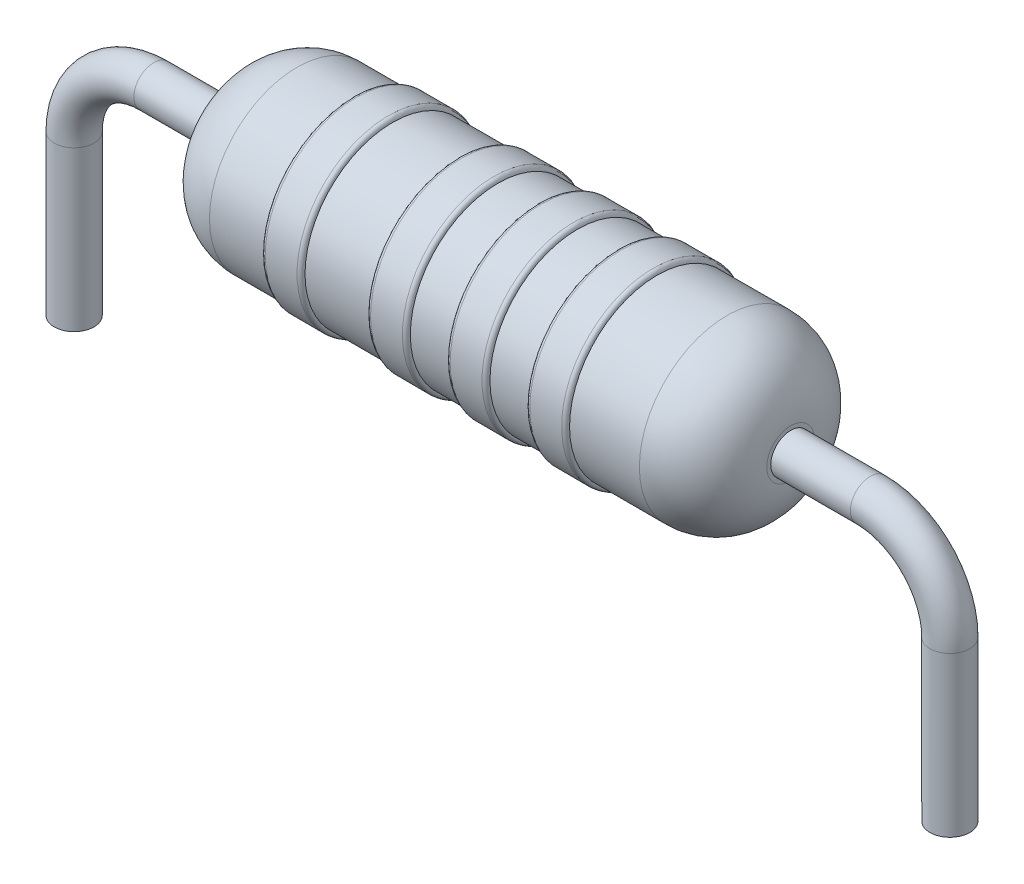
ISO-10303-21;
HEADER;
FILE_DESCRIPTION(('STEP AP214'),'2;1');
FILE_NAME('part.step','',(''),(''),'','','');
FILE_SCHEMA(('AUTOMOTIVE_DESIGN { 1 0 10303 214 1 1 1 1 }'));
ENDSEC;
DATA;
#1=APPLICATION_CONTEXT('core data for automotive mechanical design processes');
#2=APPLICATION_PROTOCOL_DEFINITION('international standard','automotive_design',2000,#1);
#3=PRODUCT_CONTEXT('',#1,'mechanical');
#4=PRODUCT('Part','Part','',(#3));
#5=PRODUCT_RELATED_PRODUCT_CATEGORY('part','',(#4));
#6=PRODUCT_DEFINITION_FORMATION('','',#4);
#7=PRODUCT_DEFINITION_CONTEXT('part definition',#1,'design');
#8=PRODUCT_DEFINITION('design','',#6,#7);
#9=PRODUCT_DEFINITION_SHAPE('','',#8);
#10=(LENGTH_UNIT() NAMED_UNIT(*) SI_UNIT(.MILLI.,.METRE.));
#11=(NAMED_UNIT(*) PLANE_ANGLE_UNIT() SI_UNIT($,.RADIAN.));
#12=(NAMED_UNIT(*) SI_UNIT($,.STERADIAN.) SOLID_ANGLE_UNIT());
#13=UNCERTAINTY_MEASURE_WITH_UNIT(LENGTH_MEASURE(1.E-05),#10,'distance_accuracy_value','');
#14=(GEOMETRIC_REPRESENTATION_CONTEXT(3) GLOBAL_UNCERTAINTY_ASSIGNED_CONTEXT((#13)) GLOBAL_UNIT_ASSIGNED_CONTEXT((#10,
#11,#12)) REPRESENTATION_CONTEXT('',''));
#15=CARTESIAN_POINT('',(0.,0.,0.));
#16=DIRECTION('',(0.,0.,1.));
#17=DIRECTION('',(1.,0.,0.));
#18=AXIS2_PLACEMENT_3D('',#15,#16,#17);
#19=CARTESIAN_POINT('',(-3.5,0.,0.));
#20=DIRECTION('',(1.,0.,0.));
#21=DIRECTION('',(0.,0.,-1.));
#22=AXIS2_PLACEMENT_3D('',#19,#20,#21);
#23=PLANE('',#22);
#24=CARTESIAN_POINT('',(-3.5,0.,0.));
#25=DIRECTION('',(-1.,0.,0.));
#26=DIRECTION('',(0.,0.,1.));
#27=AXIS2_PLACEMENT_3D('',#24,#25,#26);
#28=CIRCLE('',#27,0.299999999999995);
#29=CARTESIAN_POINT('',(-3.5,0.,0.299999999999995));
#30=VERTEX_POINT('',#29);
#31=EDGE_CURVE('E61',#30,#30,#28,.T.);
#32=ORIENTED_EDGE('',*,*,#31,.T.);
#33=EDGE_LOOP('',(#32));
#34=FACE_BOUND('',#33,.T.);
#35=CARTESIAN_POINT('',(-3.5,0.,0.));
#36=DIRECTION('',(-1.,0.,0.));
#37=DIRECTION('',(0.,0.,1.));
#38=AXIS2_PLACEMENT_3D('',#35,#36,#37);
#39=CIRCLE('',#38,0.25);
#40=CARTESIAN_POINT('',(-3.5,0.,0.25));
#41=VERTEX_POINT('',#40);
#42=EDGE_CURVE('E10',#41,#41,#39,.T.);
#43=ORIENTED_EDGE('',*,*,#42,.F.);
#44=EDGE_LOOP('',(#43));
#45=FACE_BOUND('',#44,.T.);
#46=ADVANCED_FACE('F34',(#34,#45),#23,.F.);
#47=CARTESIAN_POINT('',(-54.2686615886834,0.,0.));
#48=DIRECTION('',(-1.,0.,0.));
#49=DIRECTION('',(0.,0.,1.));
#50=AXIS2_PLACEMENT_3D('',#47,#48,#49);
#51=CYLINDRICAL_SURFACE('',#50,1.1);
#52=CARTESIAN_POINT('',(0.322975145638588,0.,0.));
#53=DIRECTION('',(-1.,0.,0.));
#54=DIRECTION('',(0.,0.,1.));
#55=AXIS2_PLACEMENT_3D('',#52,#53,#54);
#56=CIRCLE('',#55,1.1);
#57=CARTESIAN_POINT('',(0.322975145638588,0.,1.1));
#58=VERTEX_POINT('',#57);
#59=EDGE_CURVE('E81',#58,#58,#56,.T.);
#60=ORIENTED_EDGE('',*,*,#59,.T.);
#61=EDGE_LOOP('',(#60));
#62=FACE_BOUND('',#61,.T.);
#63=CARTESIAN_POINT('',(-0.177024854361413,0.,0.));
#64=DIRECTION('',(1.,0.,0.));
#65=DIRECTION('',(0.,0.,-1.));
#66=AXIS2_PLACEMENT_3D('',#63,#64,#65);
#67=CIRCLE('',#66,1.1);
#68=CARTESIAN_POINT('',(-0.177024854361413,0.,-1.1));
#69=VERTEX_POINT('',#68);
#70=EDGE_CURVE('E65',#69,#69,#67,.T.);
#71=ORIENTED_EDGE('',*,*,#70,.T.);
#72=EDGE_LOOP('',(#71));
#73=FACE_BOUND('',#72,.T.);
#74=ADVANCED_FACE('F149',(#62,#73),#51,.T.);
#75=CARTESIAN_POINT('',(4.3261723446646,0.,0.));
#76=DIRECTION('',(1.,0.,0.));
#77=DIRECTION('',(0.,0.,-1.));
#78=AXIS2_PLACEMENT_3D('',#75,#76,#77);
#79=CYLINDRICAL_SURFACE('',#78,1.15);
#80=CARTESIAN_POINT('',(-0.627024854361412,0.,0.));
#81=DIRECTION('',(-1.,0.,0.));
#82=DIRECTION('',(0.,0.,1.));
#83=AXIS2_PLACEMENT_3D('',#80,#81,#82);
#84=CIRCLE('',#83,1.15);
#85=CARTESIAN_POINT('',(-0.627024854361412,0.,1.15));
#86=VERTEX_POINT('',#85);
#87=EDGE_CURVE('E105',#86,#86,#84,.F.);
#88=ORIENTED_EDGE('',*,*,#87,.T.);
#89=EDGE_LOOP('',(#88));
#90=FACE_BOUND('',#89,.T.);
#91=CARTESIAN_POINT('',(-0.227024854361414,0.,0.));
#92=DIRECTION('',(1.,0.,0.));
#93=DIRECTION('',(0.,0.,-1.));
#94=AXIS2_PLACEMENT_3D('',#91,#92,#93);
#95=CIRCLE('',#94,1.15);
#96=CARTESIAN_POINT('',(-0.227024854361414,0.,-1.15));
#97=VERTEX_POINT('',#96);
#98=EDGE_CURVE('E102',#97,#97,#95,.F.);
#99=ORIENTED_EDGE('',*,*,#98,.T.);
#100=EDGE_LOOP('',(#99));
#101=FACE_BOUND('',#100,.T.);
#102=ADVANCED_FACE('F155',(#90,#101),#79,.T.);
#103=CARTESIAN_POINT('',(-1.5,0.,0.));
#104=DIRECTION('',(1.,0.,0.));
#105=DIRECTION('',(0.,0.,-1.));
#106=AXIS2_PLACEMENT_3D('',#103,#104,#105);
#107=CIRCLE('',#106,1.1);
#108=CARTESIAN_POINT('',(-1.5,0.,-1.1));
#109=VERTEX_POINT('',#108);
#110=EDGE_CURVE('E60',#109,#109,#107,.T.);
#111=ORIENTED_EDGE('',*,*,#110,.T.);
#112=EDGE_LOOP('',(#111));
#113=FACE_BOUND('',#112,.T.);
#114=CARTESIAN_POINT('',(-0.677024854361413,0.,0.));
#115=DIRECTION('',(-1.,0.,0.));
#116=DIRECTION('',(0.,0.,1.));
#117=AXIS2_PLACEMENT_3D('',#114,#115,#116);
#118=CIRCLE('',#117,1.1);
#119=CARTESIAN_POINT('',(-0.677024854361413,0.,1.1));
#120=VERTEX_POINT('',#119);
#121=EDGE_CURVE('E75',#120,#120,#118,.T.);
#122=ORIENTED_EDGE('',*,*,#121,.T.);
#123=EDGE_LOOP('',(#122));
#124=FACE_BOUND('',#123,.T.);
#125=ADVANCED_FACE('F157',(#113,#124),#51,.T.);
#126=CARTESIAN_POINT('',(4.3261723446646,0.,0.));
#127=DIRECTION('',(1.,0.,0.));
#128=DIRECTION('',(0.,0.,-1.));
#129=AXIS2_PLACEMENT_3D('',#126,#127,#128);
#130=CYLINDRICAL_SURFACE('',#129,1.15);
#131=CARTESIAN_POINT('',(0.372975145638589,0.,0.));
#132=DIRECTION('',(-1.,0.,0.));
#133=DIRECTION('',(0.,0.,1.));
#134=AXIS2_PLACEMENT_3D('',#131,#132,#133);
#135=CIRCLE('',#134,1.15);
#136=CARTESIAN_POINT('',(0.372975145638589,0.,1.15));
#137=VERTEX_POINT('',#136);
#138=EDGE_CURVE('E111',#137,#137,#135,.F.);
#139=ORIENTED_EDGE('',*,*,#138,.T.);
#140=EDGE_LOOP('',(#139));
#141=FACE_BOUND('',#140,.T.);
#142=CARTESIAN_POINT('',(0.772975145638587,0.,0.));
#143=DIRECTION('',(1.,0.,0.));
#144=DIRECTION('',(0.,0.,-1.));
#145=AXIS2_PLACEMENT_3D('',#142,#143,#144);
#146=CIRCLE('',#145,1.15);
#147=CARTESIAN_POINT('',(0.772975145638587,0.,-1.15));
#148=VERTEX_POINT('',#147);
#149=EDGE_CURVE('E108',#148,#148,#146,.F.);
#150=ORIENTED_EDGE('',*,*,#149,.T.);
#151=EDGE_LOOP('',(#150));
#152=FACE_BOUND('',#151,.T.);
#153=ADVANCED_FACE('F166',(#141,#152),#130,.T.);
#154=CARTESIAN_POINT('',(1.32297514563859,0.,0.));
#155=DIRECTION('',(-1.,0.,0.));
#156=DIRECTION('',(0.,0.,1.));
#157=AXIS2_PLACEMENT_3D('',#154,#155,#156);
#158=CIRCLE('',#157,1.1);
#159=CARTESIAN_POINT('',(1.32297514563859,0.,1.1));
#160=VERTEX_POINT('',#159);
#161=EDGE_CURVE('E87',#160,#160,#158,.T.);
#162=ORIENTED_EDGE('',*,*,#161,.T.);
#163=EDGE_LOOP('',(#162));
#164=FACE_BOUND('',#163,.T.);
#165=CARTESIAN_POINT('',(0.822975145638588,0.,0.));
#166=DIRECTION('',(1.,0.,0.));
#167=DIRECTION('',(0.,0.,-1.));
#168=AXIS2_PLACEMENT_3D('',#165,#166,#167);
#169=CIRCLE('',#168,1.1);
#170=CARTESIAN_POINT('',(0.822975145638588,0.,-1.1));
#171=VERTEX_POINT('',#170);
#172=EDGE_CURVE('E78',#171,#171,#169,.T.);
#173=ORIENTED_EDGE('',*,*,#172,.T.);
#174=EDGE_LOOP('',(#173));
#175=FACE_BOUND('',#174,.T.);
#176=ADVANCED_FACE('F132',(#164,#175),#51,.T.);
#177=CARTESIAN_POINT('',(4.3261723446646,0.,0.));
#178=DIRECTION('',(1.,0.,0.));
#179=DIRECTION('',(0.,0.,-1.));
#180=AXIS2_PLACEMENT_3D('',#177,#178,#179);
#181=CYLINDRICAL_SURFACE('',#180,1.15);
#182=CARTESIAN_POINT('',(1.37297514563859,0.,0.));
#183=DIRECTION('',(-1.,0.,0.));
#184=DIRECTION('',(0.,0.,1.));
#185=AXIS2_PLACEMENT_3D('',#182,#183,#184);
#186=CIRCLE('',#185,1.15);
#187=CARTESIAN_POINT('',(1.37297514563859,0.,1.15));
#188=VERTEX_POINT('',#187);
#189=EDGE_CURVE('E38',#188,#188,#186,.F.);
#190=ORIENTED_EDGE('',*,*,#189,.T.);
#191=EDGE_LOOP('',(#190));
#192=FACE_BOUND('',#191,.T.);
#193=CARTESIAN_POINT('',(1.77297514563859,0.,0.));
#194=DIRECTION('',(1.,0.,0.));
#195=DIRECTION('',(0.,0.,-1.));
#196=AXIS2_PLACEMENT_3D('',#193,#194,#195);
#197=CIRCLE('',#196,1.15);
#198=CARTESIAN_POINT('',(1.77297514563859,0.,-1.15));
#199=VERTEX_POINT('',#198);
#200=EDGE_CURVE('E46',#199,#199,#197,.F.);
#201=ORIENTED_EDGE('',*,*,#200,.T.);
#202=EDGE_LOOP('',(#201));
#203=FACE_BOUND('',#202,.T.);
#204=ADVANCED_FACE('F116',(#192,#203),#181,.T.);
#205=CARTESIAN_POINT('',(3.5,0.299999999999995,0.));
#206=DIRECTION('',(-1.,0.,0.));
#207=DIRECTION('',(0.,0.,1.));
#208=AXIS2_PLACEMENT_3D('',#205,#206,#207);
#209=PLANE('',#208);
#210=CARTESIAN_POINT('',(3.5,0.,0.));
#211=DIRECTION('',(-1.,0.,0.));
#212=DIRECTION('',(0.,0.,1.));
#213=AXIS2_PLACEMENT_3D('',#210,#211,#212);
#214=CIRCLE('',#213,0.25);
#215=CARTESIAN_POINT('',(3.5,0.,0.25));
#216=VERTEX_POINT('',#215);
#217=EDGE_CURVE('E263',#216,#216,#214,.T.);
#218=ORIENTED_EDGE('',*,*,#217,.T.);
#219=EDGE_LOOP('',(#218));
#220=FACE_BOUND('',#219,.T.);
#221=CARTESIAN_POINT('',(3.5,0.,0.));
#222=DIRECTION('',(-1.,0.,0.));
#223=DIRECTION('',(0.,0.,1.));
#224=AXIS2_PLACEMENT_3D('',#221,#222,#223);
#225=CIRCLE('',#224,0.299999999999995);
#226=CARTESIAN_POINT('',(3.5,0.,0.299999999999995));
#227=VERTEX_POINT('',#226);
#228=EDGE_CURVE('E71',#227,#227,#225,.T.);
#229=ORIENTED_EDGE('',*,*,#228,.F.);
#230=EDGE_LOOP('',(#229));
#231=FACE_BOUND('',#230,.T.);
#232=ADVANCED_FACE('F36',(#220,#231),#209,.F.);
#233=CARTESIAN_POINT('',(2.7,0.,0.));
#234=DIRECTION('',(-1.,0.,0.));
#235=DIRECTION('',(0.,0.,1.));
#236=AXIS2_PLACEMENT_3D('',#233,#234,#235);
#237=DEGENERATE_TOROIDAL_SURFACE('',#236,0.3,0.8,.T.);
#238=CARTESIAN_POINT('',(2.69999999999999,0.,0.));
#239=DIRECTION('',(-1.,0.,0.));
#240=DIRECTION('',(0.,0.,1.));
#241=AXIS2_PLACEMENT_3D('',#238,#239,#240);
#242=CIRCLE('',#241,1.1);
#243=CARTESIAN_POINT('',(2.69999999999999,0.,1.1));
#244=VERTEX_POINT('',#243);
#245=EDGE_CURVE('E68',#244,#244,#242,.T.);
#246=ORIENTED_EDGE('',*,*,#245,.F.);
#247=EDGE_LOOP('',(#246));
#248=FACE_BOUND('',#247,.T.);
#249=ORIENTED_EDGE('',*,*,#228,.T.);
#250=EDGE_LOOP('',(#249));
#251=FACE_BOUND('',#250,.T.);
#252=ADVANCED_FACE('F130',(#248,#251),#237,.T.);
#253=CARTESIAN_POINT('',(1.82297514563859,0.,0.));
#254=DIRECTION('',(1.,0.,0.));
#255=DIRECTION('',(0.,0.,-1.));
#256=AXIS2_PLACEMENT_3D('',#253,#254,#255);
#257=CIRCLE('',#256,1.1);
#258=CARTESIAN_POINT('',(1.82297514563859,0.,-1.1));
#259=VERTEX_POINT('',#258);
#260=EDGE_CURVE('E84',#259,#259,#257,.T.);
#261=ORIENTED_EDGE('',*,*,#260,.T.);
#262=EDGE_LOOP('',(#261));
#263=FACE_BOUND('',#262,.T.);
#264=ORIENTED_EDGE('',*,*,#245,.T.);
#265=EDGE_LOOP('',(#264));
#266=FACE_BOUND('',#265,.T.);
#267=ADVANCED_FACE('F126',(#263,#266),#51,.T.);
#268=CARTESIAN_POINT('',(4.3261723446646,0.,0.));
#269=DIRECTION('',(1.,0.,0.));
#270=DIRECTION('',(0.,0.,-1.));
#271=AXIS2_PLACEMENT_3D('',#268,#269,#270);
#272=CYLINDRICAL_SURFACE('',#271,1.15);
#273=CARTESIAN_POINT('',(-1.95,0.,0.));
#274=DIRECTION('',(-1.,0.,0.));
#275=DIRECTION('',(0.,0.,1.));
#276=AXIS2_PLACEMENT_3D('',#273,#274,#275);
#277=CIRCLE('',#276,1.15);
#278=CARTESIAN_POINT('',(-1.95,0.,1.15));
#279=VERTEX_POINT('',#278);
#280=EDGE_CURVE('E99',#279,#279,#277,.F.);
#281=ORIENTED_EDGE('',*,*,#280,.T.);
#282=EDGE_LOOP('',(#281));
#283=FACE_BOUND('',#282,.T.);
#284=CARTESIAN_POINT('',(-1.55,0.,0.));
#285=DIRECTION('',(1.,0.,0.));
#286=DIRECTION('',(0.,0.,-1.));
#287=AXIS2_PLACEMENT_3D('',#284,#285,#286);
#288=CIRCLE('',#287,1.15);
#289=CARTESIAN_POINT('',(-1.55,0.,-1.15));
#290=VERTEX_POINT('',#289);
#291=EDGE_CURVE('E74',#290,#290,#288,.F.);
#292=ORIENTED_EDGE('',*,*,#291,.T.);
#293=EDGE_LOOP('',(#292));
#294=FACE_BOUND('',#293,.T.);
#295=ADVANCED_FACE('F129',(#283,#294),#272,.T.);
#296=CARTESIAN_POINT('',(-2.7,0.,0.));
#297=DIRECTION('',(-1.,0.,0.));
#298=DIRECTION('',(0.,0.,1.));
#299=AXIS2_PLACEMENT_3D('',#296,#297,#298);
#300=DEGENERATE_TOROIDAL_SURFACE('',#299,0.3,0.8,.T.);
#301=ORIENTED_EDGE('',*,*,#31,.F.);
#302=EDGE_LOOP('',(#301));
#303=FACE_BOUND('',#302,.T.);
#304=CARTESIAN_POINT('',(-2.69999999999999,0.,0.));
#305=DIRECTION('',(-1.,0.,0.));
#306=DIRECTION('',(0.,0.,1.));
#307=AXIS2_PLACEMENT_3D('',#304,#305,#306);
#308=CIRCLE('',#307,1.1);
#309=CARTESIAN_POINT('',(-2.69999999999999,0.,1.1));
#310=VERTEX_POINT('',#309);
#311=EDGE_CURVE('E64',#310,#310,#308,.T.);
#312=ORIENTED_EDGE('',*,*,#311,.T.);
#313=EDGE_LOOP('',(#312));
#314=FACE_BOUND('',#313,.T.);
#315=ADVANCED_FACE('F162',(#303,#314),#300,.T.);
#316=CARTESIAN_POINT('',(-2.,0.,0.));
#317=DIRECTION('',(-1.,0.,0.));
#318=DIRECTION('',(0.,0.,1.));
#319=AXIS2_PLACEMENT_3D('',#316,#317,#318);
#320=CIRCLE('',#319,1.1);
#321=CARTESIAN_POINT('',(-2.,0.,1.1));
#322=VERTEX_POINT('',#321);
#323=EDGE_CURVE('E90',#322,#322,#320,.T.);
#324=ORIENTED_EDGE('',*,*,#323,.T.);
#325=EDGE_LOOP('',(#324));
#326=FACE_BOUND('',#325,.T.);
#327=ORIENTED_EDGE('',*,*,#311,.F.);
#328=EDGE_LOOP('',(#327));
#329=FACE_BOUND('',#328,.T.);
#330=ADVANCED_FACE('F133',(#326,#329),#51,.T.);
#331=CARTESIAN_POINT('',(-1.95,0.,0.));
#332=DIRECTION('',(-1.,0.,0.));
#333=DIRECTION('',(0.,0.,1.));
#334=AXIS2_PLACEMENT_3D('',#331,#332,#333);
#335=TOROIDAL_SURFACE('',#334,1.1,0.05);
#336=ORIENTED_EDGE('',*,*,#323,.F.);
#337=EDGE_LOOP('',(#336));
#338=FACE_BOUND('',#337,.T.);
#339=ORIENTED_EDGE('',*,*,#280,.F.);
#340=EDGE_LOOP('',(#339));
#341=FACE_BOUND('',#340,.T.);
#342=ADVANCED_FACE('F176',(#338,#341),#335,.T.);
#343=CARTESIAN_POINT('',(-1.55,0.,0.));
#344=DIRECTION('',(1.,0.,0.));
#345=DIRECTION('',(0.,0.,-1.));
#346=AXIS2_PLACEMENT_3D('',#343,#344,#345);
#347=TOROIDAL_SURFACE('',#346,1.1,0.05);
#348=ORIENTED_EDGE('',*,*,#291,.F.);
#349=EDGE_LOOP('',(#348));
#350=FACE_BOUND('',#349,.T.);
#351=ORIENTED_EDGE('',*,*,#110,.F.);
#352=EDGE_LOOP('',(#351));
#353=FACE_BOUND('',#352,.T.);
#354=ADVANCED_FACE('F181',(#350,#353),#347,.T.);
#355=CARTESIAN_POINT('',(-0.627024854361412,0.,0.));
#356=DIRECTION('',(-1.,0.,0.));
#357=DIRECTION('',(0.,0.,1.));
#358=AXIS2_PLACEMENT_3D('',#355,#356,#357);
#359=TOROIDAL_SURFACE('',#358,1.1,0.05);
#360=ORIENTED_EDGE('',*,*,#121,.F.);
#361=EDGE_LOOP('',(#360));
#362=FACE_BOUND('',#361,.T.);
#363=ORIENTED_EDGE('',*,*,#87,.F.);
#364=EDGE_LOOP('',(#363));
#365=FACE_BOUND('',#364,.T.);
#366=ADVANCED_FACE('F198',(#362,#365),#359,.T.);
#367=CARTESIAN_POINT('',(-0.227024854361414,0.,0.));
#368=DIRECTION('',(1.,0.,0.));
#369=DIRECTION('',(0.,0.,-1.));
#370=AXIS2_PLACEMENT_3D('',#367,#368,#369);
#371=TOROIDAL_SURFACE('',#370,1.1,0.05);
#372=ORIENTED_EDGE('',*,*,#98,.F.);
#373=EDGE_LOOP('',(#372));
#374=FACE_BOUND('',#373,.T.);
#375=ORIENTED_EDGE('',*,*,#70,.F.);
#376=EDGE_LOOP('',(#375));
#377=FACE_BOUND('',#376,.T.);
#378=ADVANCED_FACE('F204',(#374,#377),#371,.T.);
#379=CARTESIAN_POINT('',(0.372975145638589,0.,0.));
#380=DIRECTION('',(-1.,0.,0.));
#381=DIRECTION('',(0.,0.,1.));
#382=AXIS2_PLACEMENT_3D('',#379,#380,#381);
#383=TOROIDAL_SURFACE('',#382,1.1,0.05);
#384=ORIENTED_EDGE('',*,*,#59,.F.);
#385=EDGE_LOOP('',(#384));
#386=FACE_BOUND('',#385,.T.);
#387=ORIENTED_EDGE('',*,*,#138,.F.);
#388=EDGE_LOOP('',(#387));
#389=FACE_BOUND('',#388,.T.);
#390=ADVANCED_FACE('F210',(#386,#389),#383,.T.);
#391=CARTESIAN_POINT('',(0.772975145638587,0.,0.));
#392=DIRECTION('',(1.,0.,0.));
#393=DIRECTION('',(0.,0.,-1.));
#394=AXIS2_PLACEMENT_3D('',#391,#392,#393);
#395=TOROIDAL_SURFACE('',#394,1.1,0.05);
#396=ORIENTED_EDGE('',*,*,#149,.F.);
#397=EDGE_LOOP('',(#396));
#398=FACE_BOUND('',#397,.T.);
#399=ORIENTED_EDGE('',*,*,#172,.F.);
#400=EDGE_LOOP('',(#399));
#401=FACE_BOUND('',#400,.T.);
#402=ADVANCED_FACE('F214',(#398,#401),#395,.T.);
#403=CARTESIAN_POINT('',(1.37297514563859,0.,0.));
#404=DIRECTION('',(-1.,0.,0.));
#405=DIRECTION('',(0.,0.,1.));
#406=AXIS2_PLACEMENT_3D('',#403,#404,#405);
#407=TOROIDAL_SURFACE('',#406,1.1,0.05);
#408=ORIENTED_EDGE('',*,*,#161,.F.);
#409=EDGE_LOOP('',(#408));
#410=FACE_BOUND('',#409,.T.);
#411=ORIENTED_EDGE('',*,*,#189,.F.);
#412=EDGE_LOOP('',(#411));
#413=FACE_BOUND('',#412,.T.);
#414=ADVANCED_FACE('F122',(#410,#413),#407,.T.);
#415=CARTESIAN_POINT('',(1.77297514563859,0.,0.));
#416=DIRECTION('',(1.,0.,0.));
#417=DIRECTION('',(0.,0.,-1.));
#418=AXIS2_PLACEMENT_3D('',#415,#416,#417);
#419=TOROIDAL_SURFACE('',#418,1.1,0.05);
#420=ORIENTED_EDGE('',*,*,#200,.F.);
#421=EDGE_LOOP('',(#420));
#422=FACE_BOUND('',#421,.T.);
#423=ORIENTED_EDGE('',*,*,#260,.F.);
#424=EDGE_LOOP('',(#423));
#425=FACE_BOUND('',#424,.T.);
#426=ADVANCED_FACE('F118',(#422,#425),#419,.T.);
#427=CARTESIAN_POINT('',(-5.5,-1.00000000000001,0.));
#428=DIRECTION('',(0.,-1.,0.));
#429=DIRECTION('',(0.,0.,-1.));
#430=AXIS2_PLACEMENT_3D('',#427,#428,#429);
#431=CYLINDRICAL_SURFACE('',#430,0.25);
#432=CARTESIAN_POINT('',(-5.5,-1.00000000000001,0.));
#433=DIRECTION('',(0.,-1.,0.));
#434=DIRECTION('',(0.,0.,1.));
#435=AXIS2_PLACEMENT_3D('',#432,#433,#434);
#436=CIRCLE('',#435,0.25);
#437=CARTESIAN_POINT('',(-5.75,-1.00000000000001,0.));
#438=VERTEX_POINT('',#437);
#439=EDGE_CURVE('E54',#438,#438,#436,.T.);
#440=ORIENTED_EDGE('',*,*,#439,.T.);
#441=EDGE_LOOP('',(#440));
#442=FACE_BOUND('',#441,.T.);
#443=CARTESIAN_POINT('',(-5.5,-3.,0.));
#444=DIRECTION('',(0.,-1.,0.));
#445=DIRECTION('',(0.,0.,1.));
#446=AXIS2_PLACEMENT_3D('',#443,#444,#445);
#447=CIRCLE('',#446,0.25);
#448=CARTESIAN_POINT('',(-5.5,-3.,0.25));
#449=VERTEX_POINT('',#448);
#450=EDGE_CURVE('E57',#449,#449,#447,.T.);
#451=ORIENTED_EDGE('',*,*,#450,.F.);
#452=EDGE_LOOP('',(#451));
#453=FACE_BOUND('',#452,.T.);
#454=ADVANCED_FACE('F121',(#442,#453),#431,.T.);
#455=CARTESIAN_POINT('',(-4.5,-1.,0.));
#456=DIRECTION('',(0.,0.,1.));
#457=DIRECTION('',(1.,0.,0.));
#458=AXIS2_PLACEMENT_3D('',#455,#456,#457);
#459=TOROIDAL_SURFACE('',#458,1.,0.25);
#460=CARTESIAN_POINT('',(-4.49999999999999,0.,0.));
#461=DIRECTION('',(-1.,0.,0.));
#462=DIRECTION('',(0.,0.,1.));
#463=AXIS2_PLACEMENT_3D('',#460,#461,#462);
#464=CIRCLE('',#463,0.25);
#465=CARTESIAN_POINT('',(-4.49999999999999,0.25,0.));
#466=VERTEX_POINT('',#465);
#467=EDGE_CURVE('E51',#466,#466,#464,.T.);
#468=CARTESIAN_POINT('',(-4.5,-1.,0.));
#469=DIRECTION('',(0.,0.,1.));
#470=DIRECTION('',(1.,0.,0.));
#471=AXIS2_PLACEMENT_3D('',#468,#469,#470);
#472=CIRCLE('',#471,1.25);
#473=EDGE_CURVE('',#466,#438,#472,.T.);
#474=ORIENTED_EDGE('',*,*,#467,.T.);
#475=ORIENTED_EDGE('',*,*,#439,.F.);
#476=ORIENTED_EDGE('',*,*,#473,.T.);
#477=ORIENTED_EDGE('',*,*,#473,.F.);
#478=EDGE_LOOP('',(#474,#476,#475,#477));
#479=FACE_BOUND('',#478,.T.);
#480=ADVANCED_FACE('F224',(#479),#459,.T.);
#481=CARTESIAN_POINT('',(-4.49999999999999,0.,0.));
#482=DIRECTION('',(1.,0.,0.));
#483=DIRECTION('',(0.,0.,-1.));
#484=AXIS2_PLACEMENT_3D('',#481,#482,#483);
#485=CYLINDRICAL_SURFACE('',#484,0.25);
#486=ORIENTED_EDGE('',*,*,#467,.F.);
#487=EDGE_LOOP('',(#486));
#488=FACE_BOUND('',#487,.T.);
#489=ORIENTED_EDGE('',*,*,#42,.T.);
#490=EDGE_LOOP('',(#489));
#491=FACE_BOUND('',#490,.T.);
#492=ADVANCED_FACE('F228',(#488,#491),#485,.T.);
#493=CARTESIAN_POINT('',(-5.5,-3.,0.));
#494=DIRECTION('',(0.,-1.,0.));
#495=DIRECTION('',(0.,0.,1.));
#496=AXIS2_PLACEMENT_3D('',#493,#494,#495);
#497=PLANE('',#496);
#498=ORIENTED_EDGE('',*,*,#450,.T.);
#499=EDGE_LOOP('',(#498));
#500=FACE_BOUND('',#499,.T.);
#501=ADVANCED_FACE('F232',(#500),#497,.T.);
#502=CARTESIAN_POINT('',(5.5,-1.00000000000001,0.));
#503=DIRECTION('',(0.,-1.,0.));
#504=DIRECTION('',(0.,0.,-1.));
#505=AXIS2_PLACEMENT_3D('',#502,#503,#504);
#506=CYLINDRICAL_SURFACE('',#505,0.25);
#507=CARTESIAN_POINT('',(5.5,-1.00000000000001,0.));
#508=DIRECTION('',(0.,1.,0.));
#509=DIRECTION('',(0.,0.,1.));
#510=AXIS2_PLACEMENT_3D('',#507,#508,#509);
#511=CIRCLE('',#510,0.25);
#512=CARTESIAN_POINT('',(5.75,-1.00000000000001,0.));
#513=VERTEX_POINT('',#512);
#514=EDGE_CURVE('E257',#513,#513,#511,.T.);
#515=ORIENTED_EDGE('',*,*,#514,.F.);
#516=EDGE_LOOP('',(#515));
#517=FACE_BOUND('',#516,.T.);
#518=CARTESIAN_POINT('',(5.5,-3.,0.));
#519=DIRECTION('',(0.,1.,0.));
#520=DIRECTION('',(0.,0.,1.));
#521=AXIS2_PLACEMENT_3D('',#518,#519,#520);
#522=CIRCLE('',#521,0.25);
#523=CARTESIAN_POINT('',(5.5,-3.,0.25));
#524=VERTEX_POINT('',#523);
#525=EDGE_CURVE('E49',#524,#524,#522,.T.);
#526=ORIENTED_EDGE('',*,*,#525,.T.);
#527=EDGE_LOOP('',(#526));
#528=FACE_BOUND('',#527,.T.);
#529=ADVANCED_FACE('F236',(#517,#528),#506,.T.);
#530=CARTESIAN_POINT('',(4.5,-1.,0.));
#531=DIRECTION('',(0.,0.,-1.));
#532=DIRECTION('',(-1.,0.,0.));
#533=AXIS2_PLACEMENT_3D('',#530,#531,#532);
#534=TOROIDAL_SURFACE('',#533,1.,0.25);
#535=CARTESIAN_POINT('',(4.49999999999999,0.,0.));
#536=DIRECTION('',(-1.,0.,0.));
#537=DIRECTION('',(0.,0.,1.));
#538=AXIS2_PLACEMENT_3D('',#535,#536,#537);
#539=CIRCLE('',#538,0.25);
#540=CARTESIAN_POINT('',(4.49999999999999,0.25,0.));
#541=VERTEX_POINT('',#540);
#542=EDGE_CURVE('E259',#541,#541,#539,.T.);
#543=CARTESIAN_POINT('',(4.5,-1.,0.));
#544=DIRECTION('',(0.,0.,-1.));
#545=DIRECTION('',(-1.,0.,0.));
#546=AXIS2_PLACEMENT_3D('',#543,#544,#545);
#547=CIRCLE('',#546,1.25);
#548=EDGE_CURVE('',#541,#513,#547,.T.);
#549=ORIENTED_EDGE('',*,*,#542,.F.);
#550=ORIENTED_EDGE('',*,*,#514,.T.);
#551=ORIENTED_EDGE('',*,*,#548,.T.);
#552=ORIENTED_EDGE('',*,*,#548,.F.);
#553=EDGE_LOOP('',(#549,#551,#550,#552));
#554=FACE_BOUND('',#553,.T.);
#555=ADVANCED_FACE('F240',(#554),#534,.T.);
#556=CARTESIAN_POINT('',(4.49999999999999,0.,0.));
#557=DIRECTION('',(-1.,0.,0.));
#558=DIRECTION('',(0.,0.,1.));
#559=AXIS2_PLACEMENT_3D('',#556,#557,#558);
#560=CYLINDRICAL_SURFACE('',#559,0.25);
#561=ORIENTED_EDGE('',*,*,#542,.T.);
#562=EDGE_LOOP('',(#561));
#563=FACE_BOUND('',#562,.T.);
#564=ORIENTED_EDGE('',*,*,#217,.F.);
#565=EDGE_LOOP('',(#564));
#566=FACE_BOUND('',#565,.T.);
#567=ADVANCED_FACE('F244',(#563,#566),#560,.T.);
#568=CARTESIAN_POINT('',(5.5,-3.,0.));
#569=DIRECTION('',(0.,-1.,0.));
#570=DIRECTION('',(0.,0.,1.));
#571=AXIS2_PLACEMENT_3D('',#568,#569,#570);
#572=PLANE('',#571);
#573=ORIENTED_EDGE('',*,*,#525,.F.);
#574=EDGE_LOOP('',(#573));
#575=FACE_BOUND('',#574,.T.);
#576=ADVANCED_FACE('F248',(#575),#572,.T.);
#577=CLOSED_SHELL('',(#46,#74,#102,#125,#153,#176,#204,#232,#252,#267,#295,#315,#330,#342,#354,
#366,#378,#390,#402,#414,#426,#454,#480,#492,#501,#529,#555,#567,#576));
#578=MANIFOLD_SOLID_BREP('B2',#577);
#579=ADVANCED_BREP_SHAPE_REPRESENTATION('',(#18,#578),#14);
#580=SHAPE_DEFINITION_REPRESENTATION(#9,#579);
ENDSEC;
END-ISO-10303-21;
